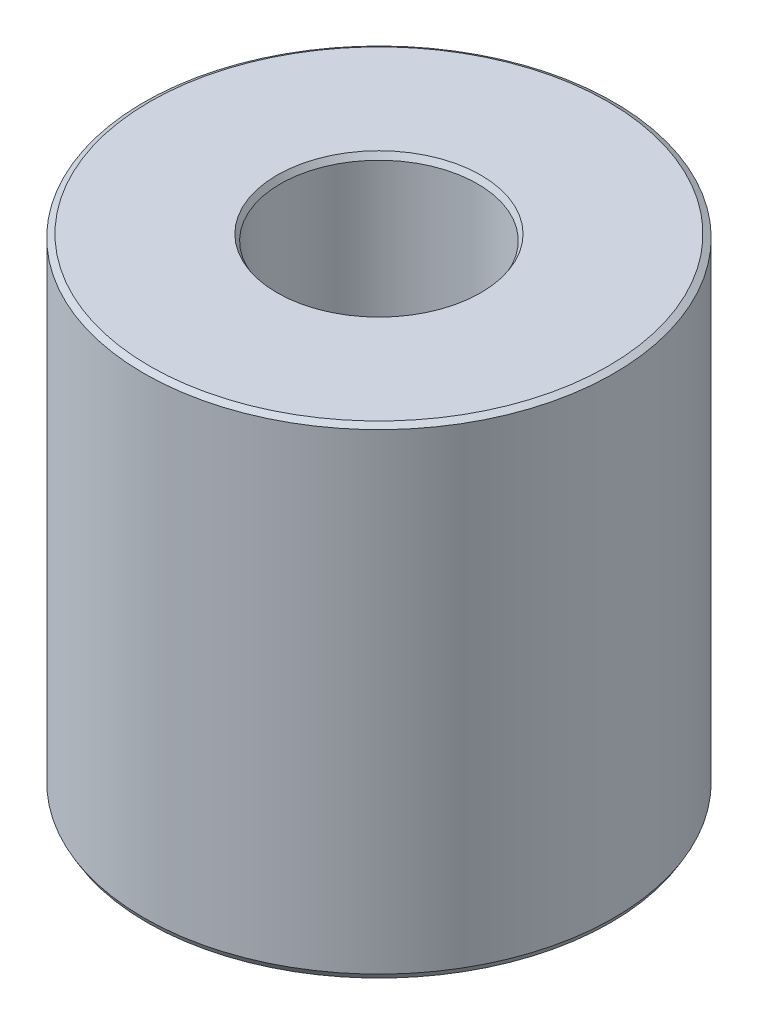
ISO-10303-21;
HEADER;
FILE_DESCRIPTION(('STEP AP214'),'2;1');
FILE_NAME('part.step','',(''),(''),'','','');
FILE_SCHEMA(('AUTOMOTIVE_DESIGN { 1 0 10303 214 1 1 1 1 }'));
ENDSEC;
DATA;
#1=APPLICATION_CONTEXT('core data for automotive mechanical design processes');
#2=APPLICATION_PROTOCOL_DEFINITION('international standard','automotive_design',2000,#1);
#3=PRODUCT_CONTEXT('',#1,'mechanical');
#4=PRODUCT('Part','Part','',(#3));
#5=PRODUCT_RELATED_PRODUCT_CATEGORY('part','',(#4));
#6=PRODUCT_DEFINITION_FORMATION('','',#4);
#7=PRODUCT_DEFINITION_CONTEXT('part definition',#1,'design');
#8=PRODUCT_DEFINITION('design','',#6,#7);
#9=PRODUCT_DEFINITION_SHAPE('','',#8);
#10=(LENGTH_UNIT() NAMED_UNIT(*) SI_UNIT(.MILLI.,.METRE.));
#11=(NAMED_UNIT(*) PLANE_ANGLE_UNIT() SI_UNIT($,.RADIAN.));
#12=(NAMED_UNIT(*) SI_UNIT($,.STERADIAN.) SOLID_ANGLE_UNIT());
#13=UNCERTAINTY_MEASURE_WITH_UNIT(LENGTH_MEASURE(1.E-05),#10,'distance_accuracy_value','');
#14=(GEOMETRIC_REPRESENTATION_CONTEXT(3) GLOBAL_UNCERTAINTY_ASSIGNED_CONTEXT((#13)) GLOBAL_UNIT_ASSIGNED_CONTEXT((#10,
#11,#12)) REPRESENTATION_CONTEXT('',''));
#15=CARTESIAN_POINT('',(0.,0.,0.));
#16=DIRECTION('',(0.,0.,1.));
#17=DIRECTION('',(1.,0.,0.));
#18=AXIS2_PLACEMENT_3D('',#15,#16,#17);
#19=CARTESIAN_POINT('',(0.,112.536433338683,0.));
#20=DIRECTION('',(0.,-1.,0.));
#21=DIRECTION('',(0.,0.,-1.));
#22=AXIS2_PLACEMENT_3D('',#19,#20,#21);
#23=CYLINDRICAL_SURFACE('',#22,55.);
#24=CARTESIAN_POINT('',(0.,1.3656727813577,0.));
#25=DIRECTION('',(0.,1.,0.));
#26=DIRECTION('',(0.,0.,1.));
#27=AXIS2_PLACEMENT_3D('',#24,#25,#26);
#28=CIRCLE('',#27,55.);
#29=CARTESIAN_POINT('',(0.,1.3656727813577,55.));
#30=VERTEX_POINT('',#29);
#31=EDGE_CURVE('E10',#30,#30,#28,.T.);
#32=ORIENTED_EDGE('',*,*,#31,.T.);
#33=EDGE_LOOP('',(#32));
#34=FACE_BOUND('',#33,.T.);
#35=CARTESIAN_POINT('',(0.,111.747961790741,0.));
#36=DIRECTION('',(0.,1.,0.));
#37=DIRECTION('',(0.,0.,1.));
#38=AXIS2_PLACEMENT_3D('',#35,#36,#37);
#39=CIRCLE('',#38,55.);
#40=CARTESIAN_POINT('',(0.,111.747961790741,55.));
#41=VERTEX_POINT('',#40);
#42=EDGE_CURVE('E50',#41,#41,#39,.F.);
#43=ORIENTED_EDGE('',*,*,#42,.T.);
#44=EDGE_LOOP('',(#43));
#45=FACE_BOUND('',#44,.T.);
#46=ADVANCED_FACE('F39',(#34,#45),#23,.T.);
#47=CARTESIAN_POINT('',(0.,112.536433338683,0.));
#48=DIRECTION('',(0.,1.,0.));
#49=DIRECTION('',(0.,0.,1.));
#50=AXIS2_PLACEMENT_3D('',#47,#48,#49);
#51=PLANE('',#50);
#52=CARTESIAN_POINT('',(0.,112.536433338683,0.));
#53=DIRECTION('',(0.,1.,0.));
#54=DIRECTION('',(0.,0.,1.));
#55=AXIS2_PLACEMENT_3D('',#52,#53,#54);
#56=CIRCLE('',#55,23.8589082033106);
#57=CARTESIAN_POINT('',(0.,112.536433338683,23.8589082033106));
#58=VERTEX_POINT('',#57);
#59=EDGE_CURVE('E58',#58,#58,#56,.F.);
#60=ORIENTED_EDGE('',*,*,#59,.T.);
#61=EDGE_LOOP('',(#60));
#62=FACE_BOUND('',#61,.T.);
#63=CARTESIAN_POINT('',(0.,112.536433338683,0.));
#64=DIRECTION('',(0.,1.,0.));
#65=DIRECTION('',(0.,0.,1.));
#66=AXIS2_PLACEMENT_3D('',#63,#64,#65);
#67=CIRCLE('',#66,53.6343272186422);
#68=CARTESIAN_POINT('',(0.,112.536433338683,53.6343272186422));
#69=VERTEX_POINT('',#68);
#70=EDGE_CURVE('E61',#69,#69,#67,.T.);
#71=ORIENTED_EDGE('',*,*,#70,.T.);
#72=EDGE_LOOP('',(#71));
#73=FACE_BOUND('',#72,.T.);
#74=ADVANCED_FACE('F88',(#62,#73),#51,.T.);
#75=CARTESIAN_POINT('',(0.,0.,0.));
#76=DIRECTION('',(0.,1.,0.));
#77=DIRECTION('',(0.,0.,1.));
#78=AXIS2_PLACEMENT_3D('',#75,#76,#77);
#79=PLANE('',#78);
#80=CARTESIAN_POINT('',(0.,0.,0.));
#81=DIRECTION('',(0.,1.,0.));
#82=DIRECTION('',(0.,0.,1.));
#83=AXIS2_PLACEMENT_3D('',#80,#81,#82);
#84=CIRCLE('',#83,24.4361094367265);
#85=CARTESIAN_POINT('',(0.,0.,24.4361094367265));
#86=VERTEX_POINT('',#85);
#87=EDGE_CURVE('E51',#86,#86,#84,.T.);
#88=ORIENTED_EDGE('',*,*,#87,.T.);
#89=EDGE_LOOP('',(#88));
#90=FACE_BOUND('',#89,.T.);
#91=CARTESIAN_POINT('',(0.,0.,0.));
#92=DIRECTION('',(0.,1.,0.));
#93=DIRECTION('',(0.,0.,1.));
#94=AXIS2_PLACEMENT_3D('',#91,#92,#93);
#95=CIRCLE('',#94,54.2115284520582);
#96=CARTESIAN_POINT('',(0.,0.,54.2115284520582));
#97=VERTEX_POINT('',#96);
#98=EDGE_CURVE('E54',#97,#97,#95,.F.);
#99=ORIENTED_EDGE('',*,*,#98,.T.);
#100=EDGE_LOOP('',(#99));
#101=FACE_BOUND('',#100,.T.);
#102=ADVANCED_FACE('F83',(#90,#101),#79,.F.);
#103=CARTESIAN_POINT('',(0.,112.536433338683,0.));
#104=DIRECTION('',(0.,-1.,0.));
#105=DIRECTION('',(0.,0.,-1.));
#106=AXIS2_PLACEMENT_3D('',#103,#104,#105);
#107=CYLINDRICAL_SURFACE('',#106,23.0704366553687);
#108=CARTESIAN_POINT('',(0.,111.170760557325,0.));
#109=DIRECTION('',(0.,1.,0.));
#110=DIRECTION('',(0.,0.,1.));
#111=AXIS2_PLACEMENT_3D('',#108,#109,#110);
#112=CIRCLE('',#111,23.0704366553687);
#113=CARTESIAN_POINT('',(0.,111.170760557325,23.0704366553687));
#114=VERTEX_POINT('',#113);
#115=EDGE_CURVE('E67',#114,#114,#112,.T.);
#116=ORIENTED_EDGE('',*,*,#115,.T.);
#117=EDGE_LOOP('',(#116));
#118=FACE_BOUND('',#117,.T.);
#119=CARTESIAN_POINT('',(0.,0.788471547941857,0.));
#120=DIRECTION('',(0.,1.,0.));
#121=DIRECTION('',(0.,0.,1.));
#122=AXIS2_PLACEMENT_3D('',#119,#120,#121);
#123=CIRCLE('',#122,23.0704366553687);
#124=CARTESIAN_POINT('',(0.,0.788471547941857,23.0704366553687));
#125=VERTEX_POINT('',#124);
#126=EDGE_CURVE('E69',#125,#125,#123,.F.);
#127=ORIENTED_EDGE('',*,*,#126,.T.);
#128=EDGE_LOOP('',(#127));
#129=FACE_BOUND('',#128,.T.);
#130=ADVANCED_FACE('F71',(#118,#129),#107,.F.);
#131=CARTESIAN_POINT('',(0.,111.170760557325,0.));
#132=DIRECTION('',(0.,1.,0.));
#133=DIRECTION('',(0.,0.,1.));
#134=AXIS2_PLACEMENT_3D('',#131,#132,#133);
#135=CONICAL_SURFACE('',#134,23.0704366553687,0.523598775598296);
#136=ORIENTED_EDGE('',*,*,#59,.F.);
#137=EDGE_LOOP('',(#136));
#138=FACE_BOUND('',#137,.T.);
#139=ORIENTED_EDGE('',*,*,#115,.F.);
#140=EDGE_LOOP('',(#139));
#141=FACE_BOUND('',#140,.T.);
#142=ADVANCED_FACE('F77',(#138,#141),#135,.F.);
#143=CARTESIAN_POINT('',(0.,0.,0.));
#144=DIRECTION('',(0.,-1.,0.));
#145=DIRECTION('',(0.,0.,-1.));
#146=AXIS2_PLACEMENT_3D('',#143,#144,#145);
#147=CONICAL_SURFACE('',#146,24.4361094367265,1.0471975511966);
#148=ORIENTED_EDGE('',*,*,#126,.F.);
#149=EDGE_LOOP('',(#148));
#150=FACE_BOUND('',#149,.T.);
#151=ORIENTED_EDGE('',*,*,#87,.F.);
#152=EDGE_LOOP('',(#151));
#153=FACE_BOUND('',#152,.T.);
#154=ADVANCED_FACE('F73',(#150,#153),#147,.F.);
#155=CARTESIAN_POINT('',(0.,1.3656727813577,0.));
#156=DIRECTION('',(0.,1.,0.));
#157=DIRECTION('',(0.,0.,1.));
#158=AXIS2_PLACEMENT_3D('',#155,#156,#157);
#159=CONICAL_SURFACE('',#158,55.,0.523598775598304);
#160=ORIENTED_EDGE('',*,*,#98,.F.);
#161=EDGE_LOOP('',(#160));
#162=FACE_BOUND('',#161,.T.);
#163=ORIENTED_EDGE('',*,*,#31,.F.);
#164=EDGE_LOOP('',(#163));
#165=FACE_BOUND('',#164,.T.);
#166=ADVANCED_FACE('F76',(#162,#165),#159,.T.);
#167=CARTESIAN_POINT('',(0.,112.536433338683,0.));
#168=DIRECTION('',(0.,-1.,0.));
#169=DIRECTION('',(0.,0.,-1.));
#170=AXIS2_PLACEMENT_3D('',#167,#168,#169);
#171=CONICAL_SURFACE('',#170,53.6343272186422,1.0471975511966);
#172=ORIENTED_EDGE('',*,*,#42,.F.);
#173=EDGE_LOOP('',(#172));
#174=FACE_BOUND('',#173,.T.);
#175=ORIENTED_EDGE('',*,*,#70,.F.);
#176=EDGE_LOOP('',(#175));
#177=FACE_BOUND('',#176,.T.);
#178=ADVANCED_FACE('F45',(#174,#177),#171,.T.);
#179=CLOSED_SHELL('',(#46,#74,#102,#130,#142,#154,#166,#178));
#180=MANIFOLD_SOLID_BREP('B2',#179);
#181=ADVANCED_BREP_SHAPE_REPRESENTATION('',(#18,#180),#14);
#182=SHAPE_DEFINITION_REPRESENTATION(#9,#181);
ENDSEC;
END-ISO-10303-21;
